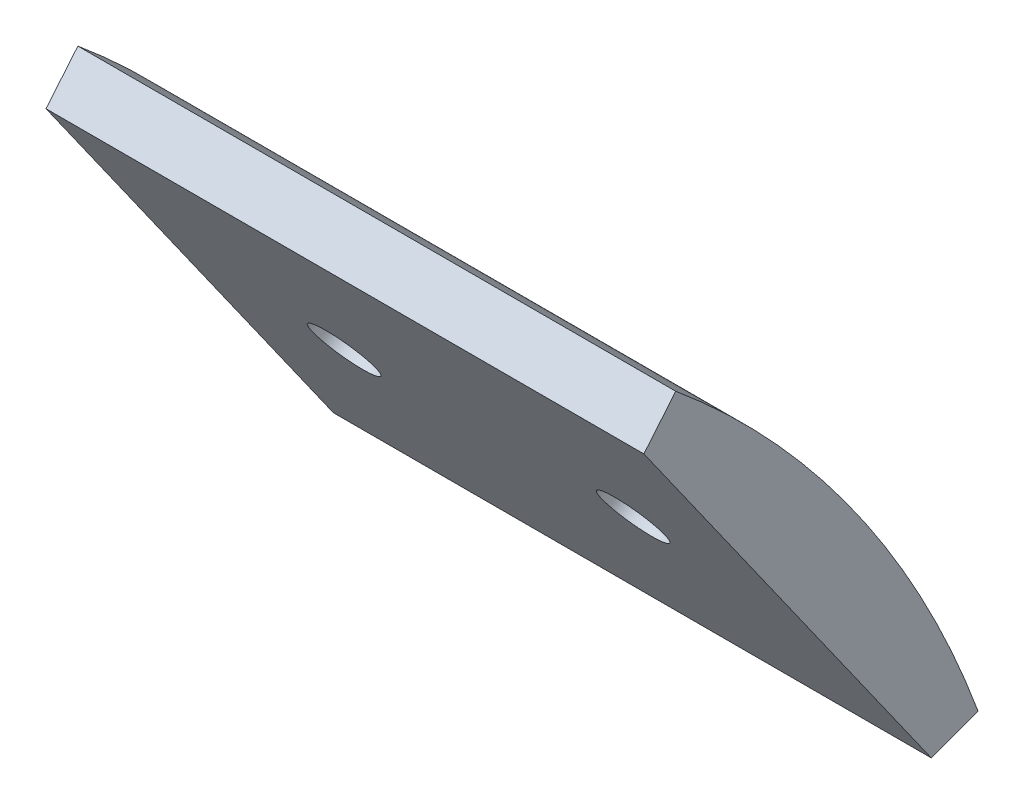
ISO-10303-21;
HEADER;
FILE_DESCRIPTION(('STEP AP214'),'2;1');
FILE_NAME('part.step','',(''),(''),'','','');
FILE_SCHEMA(('AUTOMOTIVE_DESIGN { 1 0 10303 214 1 1 1 1 }'));
ENDSEC;
DATA;
#1=APPLICATION_CONTEXT('core data for automotive mechanical design processes');
#2=APPLICATION_PROTOCOL_DEFINITION('international standard','automotive_design',2000,#1);
#3=PRODUCT_CONTEXT('',#1,'mechanical');
#4=PRODUCT('Part','Part','',(#3));
#5=PRODUCT_RELATED_PRODUCT_CATEGORY('part','',(#4));
#6=PRODUCT_DEFINITION_FORMATION('','',#4);
#7=PRODUCT_DEFINITION_CONTEXT('part definition',#1,'design');
#8=PRODUCT_DEFINITION('design','',#6,#7);
#9=PRODUCT_DEFINITION_SHAPE('','',#8);
#10=(LENGTH_UNIT() NAMED_UNIT(*) SI_UNIT(.MILLI.,.METRE.));
#11=(NAMED_UNIT(*) PLANE_ANGLE_UNIT() SI_UNIT($,.RADIAN.));
#12=(NAMED_UNIT(*) SI_UNIT($,.STERADIAN.) SOLID_ANGLE_UNIT());
#13=UNCERTAINTY_MEASURE_WITH_UNIT(LENGTH_MEASURE(1.E-05),#10,'distance_accuracy_value','');
#14=(GEOMETRIC_REPRESENTATION_CONTEXT(3) GLOBAL_UNCERTAINTY_ASSIGNED_CONTEXT((#13)) GLOBAL_UNIT_ASSIGNED_CONTEXT((#10,
#11,#12)) REPRESENTATION_CONTEXT('',''));
#15=CARTESIAN_POINT('',(0.,0.,0.));
#16=DIRECTION('',(0.,0.,1.));
#17=DIRECTION('',(1.,0.,0.));
#18=AXIS2_PLACEMENT_3D('',#15,#16,#17);
#19=CARTESIAN_POINT('',(30.,26.9110901213104,-38.1108019921217));
#20=DIRECTION('',(0.,0.576816915275249,-0.816873457918879));
#21=DIRECTION('',(0.,0.816873457918879,0.576816915275249));
#22=AXIS2_PLACEMENT_3D('',#19,#20,#21);
#23=PLANE('',#22);
#24=DIRECTION('',(0.,-0.816873457918879,-0.576816915275249));
#25=VECTOR('',#24,1.);
#26=CARTESIAN_POINT('',(0.,26.9110901213104,-38.1108019921217));
#27=LINE('',#26,#25);
#28=CARTESIAN_POINT('',(0.,37.1220083452964,-30.9005905511811));
#29=VERTEX_POINT('',#28);
#30=CARTESIAN_POINT('',(0.,16.7001718973245,-45.3210134330623));
#31=VERTEX_POINT('',#30);
#32=EDGE_CURVE('E91',#29,#31,#27,.T.);
#33=ORIENTED_EDGE('',*,*,#32,.T.);
#34=DIRECTION('',(-1.,0.,0.));
#35=VECTOR('',#34,1.);
#36=CARTESIAN_POINT('',(30.,16.7001718973245,-45.3210134330623));
#37=LINE('',#36,#35);
#38=CARTESIAN_POINT('',(30.,16.7001718973245,-45.3210134330623));
#39=VERTEX_POINT('',#38);
#40=EDGE_CURVE('E44',#39,#31,#37,.T.);
#41=ORIENTED_EDGE('',*,*,#40,.F.);
#42=DIRECTION('',(0.,-0.816873457918879,-0.576816915275249));
#43=VECTOR('',#42,1.);
#44=CARTESIAN_POINT('',(30.,26.9110901213104,-38.1108019921217));
#45=LINE('',#44,#43);
#46=CARTESIAN_POINT('',(30.,37.1220083452964,-30.9005905511811));
#47=VERTEX_POINT('',#46);
#48=EDGE_CURVE('E82',#47,#39,#45,.T.);
#49=ORIENTED_EDGE('',*,*,#48,.F.);
#50=DIRECTION('',(-1.,0.,0.));
#51=VECTOR('',#50,1.);
#52=CARTESIAN_POINT('',(30.,37.1220083452964,-30.9005905511811));
#53=LINE('',#52,#51);
#54=EDGE_CURVE('E11',#47,#29,#53,.T.);
#55=ORIENTED_EDGE('',*,*,#54,.T.);
#56=EDGE_LOOP('',(#33,#41,#49,#55));
#57=FACE_BOUND('',#56,.T.);
#58=CARTESIAN_POINT('',(22.25,26.9110901213105,-38.1108019921217));
#59=DIRECTION('',(0.,-0.576816915275249,0.816873457918879));
#60=DIRECTION('',(0.,-0.816873457918879,-0.576816915275249));
#61=AXIS2_PLACEMENT_3D('',#58,#59,#60);
#62=CIRCLE('',#61,1.605);
#63=CARTESIAN_POINT('',(22.25,25.6000082213507,-39.0365931411385));
#64=VERTEX_POINT('',#63);
#65=EDGE_CURVE('E122',#64,#64,#62,.F.);
#66=ORIENTED_EDGE('',*,*,#65,.T.);
#67=EDGE_LOOP('',(#66));
#68=FACE_BOUND('',#67,.T.);
#69=CARTESIAN_POINT('',(7.75,26.9110901213105,-38.1108019921217));
#70=DIRECTION('',(0.,-0.576816915275249,0.816873457918879));
#71=DIRECTION('',(0.,-0.816873457918879,-0.576816915275249));
#72=AXIS2_PLACEMENT_3D('',#69,#70,#71);
#73=CIRCLE('',#72,1.605);
#74=CARTESIAN_POINT('',(7.75,25.6000082213507,-39.0365931411385));
#75=VERTEX_POINT('',#74);
#76=EDGE_CURVE('E207',#75,#75,#73,.T.);
#77=ORIENTED_EDGE('',*,*,#76,.F.);
#78=EDGE_LOOP('',(#77));
#79=FACE_BOUND('',#78,.T.);
#80=ADVANCED_FACE('F35',(#57,#68,#79),#23,.F.);
#81=CARTESIAN_POINT('',(30.,0.,0.));
#82=DIRECTION('',(-1.,0.,0.));
#83=DIRECTION('',(0.,0.,1.));
#84=AXIS2_PLACEMENT_3D('',#81,#82,#83);
#85=CYLINDRICAL_SURFACE('',#84,50.8);
#86=CARTESIAN_POINT('',(7.75,27.9765887957399,-42.4022461593025));
#87=CARTESIAN_POINT('',(7.65987058778776,27.9765922519704,-42.4022441375549));
#88=CARTESIAN_POINT('',(7.56967639587621,27.9829511300087,-42.3980504755203));
#89=CARTESIAN_POINT('',(7.39177366324794,28.0082174415468,-42.3813635472706));
#90=CARTESIAN_POINT('',(7.30406821961255,28.0271398518783,-42.368860375374));
#91=CARTESIAN_POINT('',(7.13374598621466,28.0769584586338,-42.3358629449296));
#92=CARTESIAN_POINT('',(7.05112672360674,28.1078487822491,-42.315372605757));
#93=CARTESIAN_POINT('',(6.89330396850061,28.1806653966436,-42.266913787661));
#94=CARTESIAN_POINT('',(6.81809867552359,28.2225889988764,-42.2389471305114));
#95=CARTESIAN_POINT('',(6.67717869215199,28.3162410606964,-42.1762215033743));
#96=CARTESIAN_POINT('',(6.61146796757462,28.3679735966678,-42.1414597092857));
#97=CARTESIAN_POINT('',(6.49143582526226,28.4796973584833,-42.0660358417761));
#98=CARTESIAN_POINT('',(6.43711486177143,28.5396889135538,-42.0253735331412));
#99=CARTESIAN_POINT('',(6.34139743902529,28.6661730088212,-41.9391985298127));
#100=CARTESIAN_POINT('',(6.30000344441529,28.7326667855568,-41.8936849123885));
#101=CARTESIAN_POINT('',(6.23133099375862,28.8702014329054,-41.7990242862515));
#102=CARTESIAN_POINT('',(6.20405247804644,28.9412422842968,-41.7498772928977));
#103=CARTESIAN_POINT('',(6.16439408377186,29.0857888183584,-41.6493053254901));
#104=CARTESIAN_POINT('',(6.1520091966843,29.1592936638689,-41.5978811232657));
#105=CARTESIAN_POINT('',(6.14247418863297,29.3066837728354,-41.4941731440999));
#106=CARTESIAN_POINT('',(6.14532400326299,29.3805690346817,-41.4418893707934));
#107=CARTESIAN_POINT('',(6.16617328095716,29.5265994262557,-41.3379723342983));
#108=CARTESIAN_POINT('',(6.18416733832379,29.5987451674497,-41.2863388456662));
#109=CARTESIAN_POINT('',(6.23478595233854,29.7393042076529,-41.1852071345013));
#110=CARTESIAN_POINT('',(6.26741054294074,29.8077174979994,-41.1357089169243));
#111=CARTESIAN_POINT('',(6.34637032755806,29.9389309324444,-41.0403094907107));
#112=CARTESIAN_POINT('',(6.3927079978286,30.0017300600898,-40.9944089336209));
#113=CARTESIAN_POINT('',(6.4977767444566,30.1199835489618,-40.9076029630069));
#114=CARTESIAN_POINT('',(6.55650785277396,30.1754378912472,-40.8666975623645));
#115=CARTESIAN_POINT('',(6.68472691014684,30.2775224016723,-40.791122588752));
#116=CARTESIAN_POINT('',(6.7542195498026,30.3241487021654,-40.7564557492811));
#117=CARTESIAN_POINT('',(6.90197248388476,30.4072934188633,-40.6944616053342));
#118=CARTESIAN_POINT('',(6.98023277979593,30.4438118333563,-40.667134302101));
#119=CARTESIAN_POINT('',(7.14330216912199,30.5057650070818,-40.6206820234203));
#120=CARTESIAN_POINT('',(7.22811133616247,30.5311996416836,-40.6015571402042));
#121=CARTESIAN_POINT('',(7.40186982251975,30.5703071491996,-40.5721200457857));
#122=CARTESIAN_POINT('',(7.49081912933285,30.583980057633,-40.5618078079701));
#123=CARTESIAN_POINT('',(7.67029173162586,30.5991975044341,-40.5503292826454));
#124=CARTESIAN_POINT('',(7.76081432986834,30.6007472846546,-40.5491590422788));
#125=CARTESIAN_POINT('',(7.94090008892966,30.591691160391,-40.5559917014436));
#126=CARTESIAN_POINT('',(8.03046325098639,30.5810852715926,-40.5639945891382));
#127=CARTESIAN_POINT('',(8.20606943764796,30.5480027867062,-40.5889141274479));
#128=CARTESIAN_POINT('',(8.29211316624677,30.5255285772796,-40.6058289859076));
#129=CARTESIAN_POINT('',(8.45825962808515,30.4693083051244,-40.6480316835978));
#130=CARTESIAN_POINT('',(8.53836234798719,30.4355622170914,-40.673319541625));
#131=CARTESIAN_POINT('',(8.69038318422577,30.3576846224394,-40.7314784662441));
#132=CARTESIAN_POINT('',(8.76229847512221,30.3135495466545,-40.7643521388874));
#133=CARTESIAN_POINT('',(8.89587465428493,30.2160840613951,-40.8366494191934));
#134=CARTESIAN_POINT('',(8.9575355139664,30.1627536262889,-40.8760730451139));
#135=CARTESIAN_POINT('',(9.06887440573638,30.0483185013141,-40.960268474033));
#136=CARTESIAN_POINT('',(9.11854820567711,29.9872110773004,-41.0050421576039));
#137=CARTESIAN_POINT('',(9.20447398101913,29.8589055449117,-41.098565103243));
#138=CARTESIAN_POINT('',(9.24072598839731,29.791707451048,-41.1473143558392));
#139=CARTESIAN_POINT('',(9.29877169614077,29.6530893843321,-41.2473221759335));
#140=CARTESIAN_POINT('',(9.32056813632935,29.5816702143142,-41.2985802659424));
#141=CARTESIAN_POINT('',(9.34909297340323,29.4365938547909,-41.4021120302513));
#142=CARTESIAN_POINT('',(9.35582138788689,29.3629366678994,-41.454385703365));
#143=CARTESIAN_POINT('',(9.35401886503464,29.215499257364,-41.5584256244724));
#144=CARTESIAN_POINT('',(9.34549459302676,29.1417191015322,-41.610192084176));
#145=CARTESIAN_POINT('',(9.31344238386283,28.996111210387,-41.711789929113));
#146=CARTESIAN_POINT('',(9.28991441707454,28.9242834789299,-41.7616213105244));
#147=CARTESIAN_POINT('',(9.2285236667785,28.7846526569615,-41.857985780539));
#148=CARTESIAN_POINT('',(9.19066064899225,28.7168496322473,-41.9045188152222));
#149=CARTESIAN_POINT('',(9.10167671889731,28.5872471980895,-41.9930406633657));
#150=CARTESIAN_POINT('',(9.05055628158878,28.5254475736591,-42.0350296395585));
#151=CARTESIAN_POINT('',(8.93648838361105,28.4096460157762,-42.113381622741));
#152=CARTESIAN_POINT('',(8.87353702167923,28.3556466648918,-42.1497427667128));
#153=CARTESIAN_POINT('',(8.73758290636389,28.2570584280255,-42.2158996599793));
#154=CARTESIAN_POINT('',(8.66457766894232,28.2124718746061,-42.2456937819965));
#155=CARTESIAN_POINT('',(8.51055782380583,28.1340335305065,-42.2979714368867));
#156=CARTESIAN_POINT('',(8.42953790381098,28.1001889231723,-42.3204500780105));
#157=CARTESIAN_POINT('',(8.26188827138843,28.0443248251652,-42.357490237067));
#158=CARTESIAN_POINT('',(8.17526538338151,28.0222912416494,-42.3720611906641));
#159=CARTESIAN_POINT('',(8.03174654762379,27.9965504302656,-42.3890704673965));
#160=CARTESIAN_POINT('',(7.9757820382518,27.9890747467555,-42.3940058402857));
#161=CARTESIAN_POINT('',(7.86322020831319,27.9790928446371,-42.4005943207714));
#162=CARTESIAN_POINT('',(7.80662288795421,27.9765866243982,-42.4022474294448));
#163=CARTESIAN_POINT('',(7.75,27.9765887957399,-42.4022461593025));
#164=B_SPLINE_CURVE_WITH_KNOTS('',3,(#86,#87,#88,#89,#90,#91,#92,#93,#94,#95,#96,#97,#98,#99,
#100,#101,#102,#103,#104,#105,#106,#107,#108,#109,#110,#111,#112,#113,#114,#115,#116,#117,#118,
#119,#120,#121,#122,#123,#124,#125,#126,#127,#128,#129,#130,#131,#132,#133,#134,#135,#136,#137,
#138,#139,#140,#141,#142,#143,#144,#145,#146,#147,#148,#149,#150,#151,#152,#153,#154,#155,#156,
#157,#158,#159,#160,#161,#162,#163),.UNSPECIFIED.,.T.,.F.,(4,2,2,2,2,2,2,2,2,2,2,2,2,2,2,2,2,2,
2,2,2,2,2,2,2,2,2,2,2,2,2,2,2,2,2,2,2,2,4),(0.,0.270181554784089,0.540685769332764,
0.811057411775596,1.0813632320132,1.35178163279134,1.62221081629135,1.89269152816465,
2.16317109671825,2.4335596812056,2.70394712259953,2.97423809082231,3.24452968633112,
3.51487011987441,3.78521125057361,4.05567054753536,4.32612989029878,4.59659227414095,
4.86705384120991,5.13739845842034,5.40774272677934,5.67803265091342,5.94832318182872,
6.21870670769249,6.4890909872531,6.75957058939731,7.03004954713019,7.30047722520814,
7.57090458744572,7.84121380348709,8.11152355339,8.38183772117017,8.65214220520011,
8.92253597937208,9.19299668072087,9.46363786513071,9.73395539920634,9.90369427298968,
10.0734330910773),.UNSPECIFIED.);
#165=CARTESIAN_POINT('',(7.75,27.9765887957399,-42.4022461593025));
#166=VERTEX_POINT('',#165);
#167=EDGE_CURVE('E102',#166,#166,#164,.T.);
#168=ORIENTED_EDGE('',*,*,#167,.F.);
#169=EDGE_LOOP('',(#168));
#170=FACE_BOUND('',#169,.T.);
#171=CARTESIAN_POINT('',(0.,0.,0.));
#172=DIRECTION('',(1.,0.,0.));
#173=DIRECTION('',(0.,0.,-1.));
#174=AXIS2_PLACEMENT_3D('',#171,#172,#173);
#175=CIRCLE('',#174,50.8);
#176=CARTESIAN_POINT('',(0.,17.564570028656,-47.6668215817715));
#177=VERTEX_POINT('',#176);
#178=CARTESIAN_POINT('',(0.,39.0434373486762,-32.5));
#179=VERTEX_POINT('',#178);
#180=EDGE_CURVE('E75',#177,#179,#175,.T.);
#181=ORIENTED_EDGE('',*,*,#180,.T.);
#182=DIRECTION('',(-1.,0.,0.));
#183=VECTOR('',#182,1.);
#184=CARTESIAN_POINT('',(30.,39.0434373486762,-32.5));
#185=LINE('',#184,#183);
#186=CARTESIAN_POINT('',(30.,39.0434373486762,-32.5));
#187=VERTEX_POINT('',#186);
#188=EDGE_CURVE('E95',#187,#179,#185,.T.);
#189=ORIENTED_EDGE('',*,*,#188,.F.);
#190=CARTESIAN_POINT('',(30.,0.,0.));
#191=DIRECTION('',(1.,0.,0.));
#192=DIRECTION('',(0.,0.,-1.));
#193=AXIS2_PLACEMENT_3D('',#190,#191,#192);
#194=CIRCLE('',#193,50.8);
#195=CARTESIAN_POINT('',(30.,17.564570028656,-47.6668215817715));
#196=VERTEX_POINT('',#195);
#197=EDGE_CURVE('E52',#196,#187,#194,.T.);
#198=ORIENTED_EDGE('',*,*,#197,.F.);
#199=DIRECTION('',(-1.,0.,0.));
#200=VECTOR('',#199,1.);
#201=CARTESIAN_POINT('',(30.,17.564570028656,-47.6668215817715));
#202=LINE('',#201,#200);
#203=EDGE_CURVE('E92',#196,#177,#202,.T.);
#204=ORIENTED_EDGE('',*,*,#203,.T.);
#205=EDGE_LOOP('',(#181,#189,#198,#204));
#206=FACE_BOUND('',#205,.T.);
#207=CARTESIAN_POINT('',(22.25,27.9765887957399,-42.4022461593025));
#208=CARTESIAN_POINT('',(22.3401294122122,27.9765922519704,-42.4022441375549));
#209=CARTESIAN_POINT('',(22.4303236041238,27.9829511300087,-42.3980504755203));
#210=CARTESIAN_POINT('',(22.6082263367521,28.0082174415468,-42.3813635472706));
#211=CARTESIAN_POINT('',(22.6959317803875,28.0271398518783,-42.368860375374));
#212=CARTESIAN_POINT('',(22.8662540137853,28.0769584586338,-42.3358629449296));
#213=CARTESIAN_POINT('',(22.9488732763933,28.1078487822491,-42.315372605757));
#214=CARTESIAN_POINT('',(23.1066960314994,28.1806653966436,-42.266913787661));
#215=CARTESIAN_POINT('',(23.1819013244764,28.2225889988765,-42.2389471305114));
#216=CARTESIAN_POINT('',(23.322821307848,28.3162410606964,-42.1762215033743));
#217=CARTESIAN_POINT('',(23.3885320324254,28.3679735966678,-42.1414597092857));
#218=CARTESIAN_POINT('',(23.5085641747377,28.4796973584833,-42.0660358417761));
#219=CARTESIAN_POINT('',(23.5628851382286,28.5396889135538,-42.0253735331412));
#220=CARTESIAN_POINT('',(23.6586025609747,28.6661730088212,-41.9391985298127));
#221=CARTESIAN_POINT('',(23.6999965555847,28.7326667855568,-41.8936849123885));
#222=CARTESIAN_POINT('',(23.7686690062414,28.8702014329054,-41.7990242862515));
#223=CARTESIAN_POINT('',(23.7959475219536,28.9412422842968,-41.7498772928977));
#224=CARTESIAN_POINT('',(23.8356059162281,29.0857888183584,-41.6493053254901));
#225=CARTESIAN_POINT('',(23.8479908033157,29.1592936638689,-41.5978811232657));
#226=CARTESIAN_POINT('',(23.857525811367,29.3066837728354,-41.4941731440999));
#227=CARTESIAN_POINT('',(23.854675996737,29.3805690346817,-41.4418893707934));
#228=CARTESIAN_POINT('',(23.8338267190428,29.5265994262557,-41.3379723342983));
#229=CARTESIAN_POINT('',(23.8158326616762,29.5987451674497,-41.2863388456662));
#230=CARTESIAN_POINT('',(23.7652140476615,29.7393042076529,-41.1852071345013));
#231=CARTESIAN_POINT('',(23.7325894570593,29.8077174979994,-41.1357089169243));
#232=CARTESIAN_POINT('',(23.6536296724419,29.9389309324444,-41.0403094907107));
#233=CARTESIAN_POINT('',(23.6072920021714,30.0017300600898,-40.9944089336209));
#234=CARTESIAN_POINT('',(23.5022232555434,30.1199835489618,-40.9076029630069));
#235=CARTESIAN_POINT('',(23.443492147226,30.1754378912472,-40.8666975623645));
#236=CARTESIAN_POINT('',(23.3152730898532,30.2775224016723,-40.791122588752));
#237=CARTESIAN_POINT('',(23.2457804501974,30.3241487021654,-40.7564557492811));
#238=CARTESIAN_POINT('',(23.0980275161152,30.4072934188633,-40.6944616053342));
#239=CARTESIAN_POINT('',(23.0197672202041,30.4438118333563,-40.667134302101));
#240=CARTESIAN_POINT('',(22.856697830878,30.5057650070818,-40.6206820234203));
#241=CARTESIAN_POINT('',(22.7718886638375,30.5311996416836,-40.6015571402042));
#242=CARTESIAN_POINT('',(22.5981301774803,30.5703071491996,-40.5721200457857));
#243=CARTESIAN_POINT('',(22.5091808706671,30.583980057633,-40.5618078079701));
#244=CARTESIAN_POINT('',(22.3297082683741,30.5991975044341,-40.5503292826454));
#245=CARTESIAN_POINT('',(22.2391856701317,30.6007472846546,-40.5491590422788));
#246=CARTESIAN_POINT('',(22.0590999110703,30.591691160391,-40.5559917014436));
#247=CARTESIAN_POINT('',(21.9695367490136,30.5810852715926,-40.5639945891382));
#248=CARTESIAN_POINT('',(21.793930562352,30.5480027867062,-40.5889141274479));
#249=CARTESIAN_POINT('',(21.7078868337532,30.5255285772796,-40.6058289859076));
#250=CARTESIAN_POINT('',(21.5417403719148,30.4693083051244,-40.6480316835978));
#251=CARTESIAN_POINT('',(21.4616376520128,30.4355622170914,-40.673319541625));
#252=CARTESIAN_POINT('',(21.3096168157742,30.3576846224394,-40.7314784662441));
#253=CARTESIAN_POINT('',(21.2377015248778,30.3135495466545,-40.7643521388874));
#254=CARTESIAN_POINT('',(21.1041253457151,30.2160840613951,-40.8366494191934));
#255=CARTESIAN_POINT('',(21.0424644860336,30.1627536262889,-40.8760730451139));
#256=CARTESIAN_POINT('',(20.9311255942636,30.0483185013141,-40.9602684740329));
#257=CARTESIAN_POINT('',(20.8814517943229,29.9872110773004,-41.0050421576039));
#258=CARTESIAN_POINT('',(20.7955260189809,29.8589055449117,-41.098565103243));
#259=CARTESIAN_POINT('',(20.7592740116027,29.791707451048,-41.1473143558392));
#260=CARTESIAN_POINT('',(20.7012283038592,29.6530893843321,-41.2473221759334));
#261=CARTESIAN_POINT('',(20.6794318636706,29.5816702143142,-41.2985802659424));
#262=CARTESIAN_POINT('',(20.6509070265968,29.4365938547909,-41.4021120302513));
#263=CARTESIAN_POINT('',(20.6441786121131,29.3629366678994,-41.454385703365));
#264=CARTESIAN_POINT('',(20.6459811349654,29.215499257364,-41.5584256244724));
#265=CARTESIAN_POINT('',(20.6545054069732,29.1417191015322,-41.610192084176));
#266=CARTESIAN_POINT('',(20.6865576161372,28.996111210387,-41.711789929113));
#267=CARTESIAN_POINT('',(20.7100855829255,28.9242834789299,-41.7616213105244));
#268=CARTESIAN_POINT('',(20.7714763332215,28.7846526569615,-41.857985780539));
#269=CARTESIAN_POINT('',(20.8093393510077,28.7168496322473,-41.9045188152222));
#270=CARTESIAN_POINT('',(20.8983232811027,28.5872471980895,-41.9930406633657));
#271=CARTESIAN_POINT('',(20.9494437184112,28.5254475736591,-42.0350296395585));
#272=CARTESIAN_POINT('',(21.0635116163889,28.4096460157762,-42.113381622741));
#273=CARTESIAN_POINT('',(21.1264629783208,28.3556466648918,-42.1497427667128));
#274=CARTESIAN_POINT('',(21.2624170936361,28.2570584280255,-42.2158996599793));
#275=CARTESIAN_POINT('',(21.3354223310577,28.2124718746061,-42.2456937819966));
#276=CARTESIAN_POINT('',(21.4894421761942,28.1340335305065,-42.2979714368867));
#277=CARTESIAN_POINT('',(21.570462096189,28.1001889231723,-42.3204500780105));
#278=CARTESIAN_POINT('',(21.7381117286116,28.0443248251652,-42.357490237067));
#279=CARTESIAN_POINT('',(21.8247346166185,28.0222912416494,-42.3720611906641));
#280=CARTESIAN_POINT('',(21.9682534523762,27.9965504302656,-42.3890704673965));
#281=CARTESIAN_POINT('',(22.0242179617482,27.9890747467555,-42.3940058402857));
#282=CARTESIAN_POINT('',(22.1367797916868,27.9790928446371,-42.4005943207714));
#283=CARTESIAN_POINT('',(22.1933771120458,27.9765866243982,-42.4022474294448));
#284=CARTESIAN_POINT('',(22.25,27.9765887957399,-42.4022461593025));
#285=B_SPLINE_CURVE_WITH_KNOTS('',3,(#207,#208,#209,#210,#211,#212,#213,#214,#215,#216,#217,
#218,#219,#220,#221,#222,#223,#224,#225,#226,#227,#228,#229,#230,#231,#232,#233,#234,#235,#236,
#237,#238,#239,#240,#241,#242,#243,#244,#245,#246,#247,#248,#249,#250,#251,#252,#253,#254,#255,
#256,#257,#258,#259,#260,#261,#262,#263,#264,#265,#266,#267,#268,#269,#270,#271,#272,#273,#274,
#275,#276,#277,#278,#279,#280,#281,#282,#283,#284),.UNSPECIFIED.,.T.,.F.,(4,2,2,2,2,2,2,2,2,2,2,
2,2,2,2,2,2,2,2,2,2,2,2,2,2,2,2,2,2,2,2,2,2,2,2,2,2,2,4),(0.,0.270181554784089,
0.540685769332763,0.811057411775596,1.0813632320132,1.35178163279134,1.62221081629134,
1.89269152816464,2.16317109671824,2.4335596812056,2.70394712259953,2.9742380908223,
3.24452968633111,3.51487011987441,3.78521125057361,4.05567054753536,4.32612989029878,
4.59659227414095,4.86705384120991,5.13739845842034,5.40774272677933,5.67803265091342,
5.94832318182872,6.21870670769249,6.4890909872531,6.75957058939731,7.03004954713019,
7.30047722520814,7.57090458744572,7.84121380348709,8.11152355339,8.38183772117018,
8.65214220520012,8.92253597937209,9.19299668072088,9.46363786513072,9.73395539920634,
9.90369427298969,10.0734330910773),.UNSPECIFIED.);
#286=CARTESIAN_POINT('',(22.25,27.9765887957399,-42.4022461593025));
#287=VERTEX_POINT('',#286);
#288=EDGE_CURVE('E114',#287,#287,#285,.T.);
#289=ORIENTED_EDGE('',*,*,#288,.T.);
#290=EDGE_LOOP('',(#289));
#291=FACE_BOUND('',#290,.T.);
#292=ADVANCED_FACE('F107',(#170,#206,#291),#85,.T.);
#293=CARTESIAN_POINT('',(30.,0.,0.));
#294=DIRECTION('',(0.,-0.639763779527559,-0.768571601351893));
#295=DIRECTION('',(0.,0.768571601351893,-0.639763779527559));
#296=AXIS2_PLACEMENT_3D('',#293,#294,#295);
#297=PLANE('',#296);
#298=DIRECTION('',(0.,-0.768571601351893,0.639763779527559));
#299=VECTOR('',#298,1.);
#300=CARTESIAN_POINT('',(0.,0.,0.));
#301=LINE('',#300,#299);
#302=EDGE_CURVE('E99',#179,#29,#301,.T.);
#303=ORIENTED_EDGE('',*,*,#302,.T.);
#304=ORIENTED_EDGE('',*,*,#54,.F.);
#305=DIRECTION('',(0.,-0.768571601351893,0.639763779527559));
#306=VECTOR('',#305,1.);
#307=CARTESIAN_POINT('',(30.,0.,0.));
#308=LINE('',#307,#306);
#309=EDGE_CURVE('E87',#187,#47,#308,.T.);
#310=ORIENTED_EDGE('',*,*,#309,.F.);
#311=ORIENTED_EDGE('',*,*,#188,.T.);
#312=EDGE_LOOP('',(#303,#304,#310,#311));
#313=FACE_BOUND('',#312,.T.);
#314=ADVANCED_FACE('F37',(#313),#297,.F.);
#315=CARTESIAN_POINT('',(30.,0.,0.));
#316=DIRECTION('',(0.,0.938323259483692,0.345759252532598));
#317=DIRECTION('',(0.,-0.345759252532598,0.938323259483692));
#318=AXIS2_PLACEMENT_3D('',#315,#316,#317);
#319=PLANE('',#318);
#320=DIRECTION('',(0.,0.345759252532598,-0.938323259483692));
#321=VECTOR('',#320,1.);
#322=CARTESIAN_POINT('',(0.,0.,0.));
#323=LINE('',#322,#321);
#324=EDGE_CURVE('E69',#31,#177,#323,.T.);
#325=ORIENTED_EDGE('',*,*,#324,.T.);
#326=ORIENTED_EDGE('',*,*,#203,.F.);
#327=DIRECTION('',(0.,0.345759252532598,-0.938323259483692));
#328=VECTOR('',#327,1.);
#329=CARTESIAN_POINT('',(30.,0.,0.));
#330=LINE('',#329,#328);
#331=EDGE_CURVE('E85',#39,#196,#330,.T.);
#332=ORIENTED_EDGE('',*,*,#331,.F.);
#333=ORIENTED_EDGE('',*,*,#40,.T.);
#334=EDGE_LOOP('',(#325,#326,#332,#333));
#335=FACE_BOUND('',#334,.T.);
#336=ADVANCED_FACE('F93',(#335),#319,.F.);
#337=CARTESIAN_POINT('',(30.,0.,0.));
#338=DIRECTION('',(1.,0.,0.));
#339=DIRECTION('',(0.,0.,-1.));
#340=AXIS2_PLACEMENT_3D('',#337,#338,#339);
#341=PLANE('',#340);
#342=ORIENTED_EDGE('',*,*,#309,.T.);
#343=ORIENTED_EDGE('',*,*,#48,.T.);
#344=ORIENTED_EDGE('',*,*,#331,.T.);
#345=ORIENTED_EDGE('',*,*,#197,.T.);
#346=EDGE_LOOP('',(#342,#343,#344,#345));
#347=FACE_BOUND('',#346,.T.);
#348=ADVANCED_FACE('F83',(#347),#341,.T.);
#349=CARTESIAN_POINT('',(0.,0.,0.));
#350=DIRECTION('',(1.,0.,0.));
#351=DIRECTION('',(0.,0.,-1.));
#352=AXIS2_PLACEMENT_3D('',#349,#350,#351);
#353=PLANE('',#352);
#354=ORIENTED_EDGE('',*,*,#302,.F.);
#355=ORIENTED_EDGE('',*,*,#180,.F.);
#356=ORIENTED_EDGE('',*,*,#324,.F.);
#357=ORIENTED_EDGE('',*,*,#32,.F.);
#358=EDGE_LOOP('',(#354,#355,#356,#357));
#359=FACE_BOUND('',#358,.T.);
#360=ADVANCED_FACE('F111',(#359),#353,.F.);
#361=CARTESIAN_POINT('',(22.25,35.451208080609,-50.2051000331533));
#362=DIRECTION('',(0.,-0.576816915275249,0.816873457918879));
#363=DIRECTION('',(0.,-0.816873457918879,-0.576816915275249));
#364=AXIS2_PLACEMENT_3D('',#361,#362,#363);
#365=CYLINDRICAL_SURFACE('',#364,1.605);
#366=ORIENTED_EDGE('',*,*,#288,.F.);
#367=EDGE_LOOP('',(#366));
#368=FACE_BOUND('',#367,.T.);
#369=ORIENTED_EDGE('',*,*,#65,.F.);
#370=EDGE_LOOP('',(#369));
#371=FACE_BOUND('',#370,.T.);
#372=ADVANCED_FACE('F124',(#368,#371),#365,.F.);
#373=CARTESIAN_POINT('',(7.75,35.451208080609,-50.2051000331533));
#374=DIRECTION('',(0.,-0.576816915275249,0.816873457918879));
#375=DIRECTION('',(0.,-0.816873457918879,-0.576816915275249));
#376=AXIS2_PLACEMENT_3D('',#373,#374,#375);
#377=CYLINDRICAL_SURFACE('',#376,1.605);
#378=ORIENTED_EDGE('',*,*,#167,.T.);
#379=EDGE_LOOP('',(#378));
#380=FACE_BOUND('',#379,.T.);
#381=ORIENTED_EDGE('',*,*,#76,.T.);
#382=EDGE_LOOP('',(#381));
#383=FACE_BOUND('',#382,.T.);
#384=ADVANCED_FACE('F167',(#380,#383),#377,.F.);
#385=CLOSED_SHELL('',(#80,#292,#314,#336,#348,#360,#372,#384));
#386=MANIFOLD_SOLID_BREP('B2',#385);
#387=ADVANCED_BREP_SHAPE_REPRESENTATION('',(#18,#386),#14);
#388=SHAPE_DEFINITION_REPRESENTATION(#9,#387);
ENDSEC;
END-ISO-10303-21;
